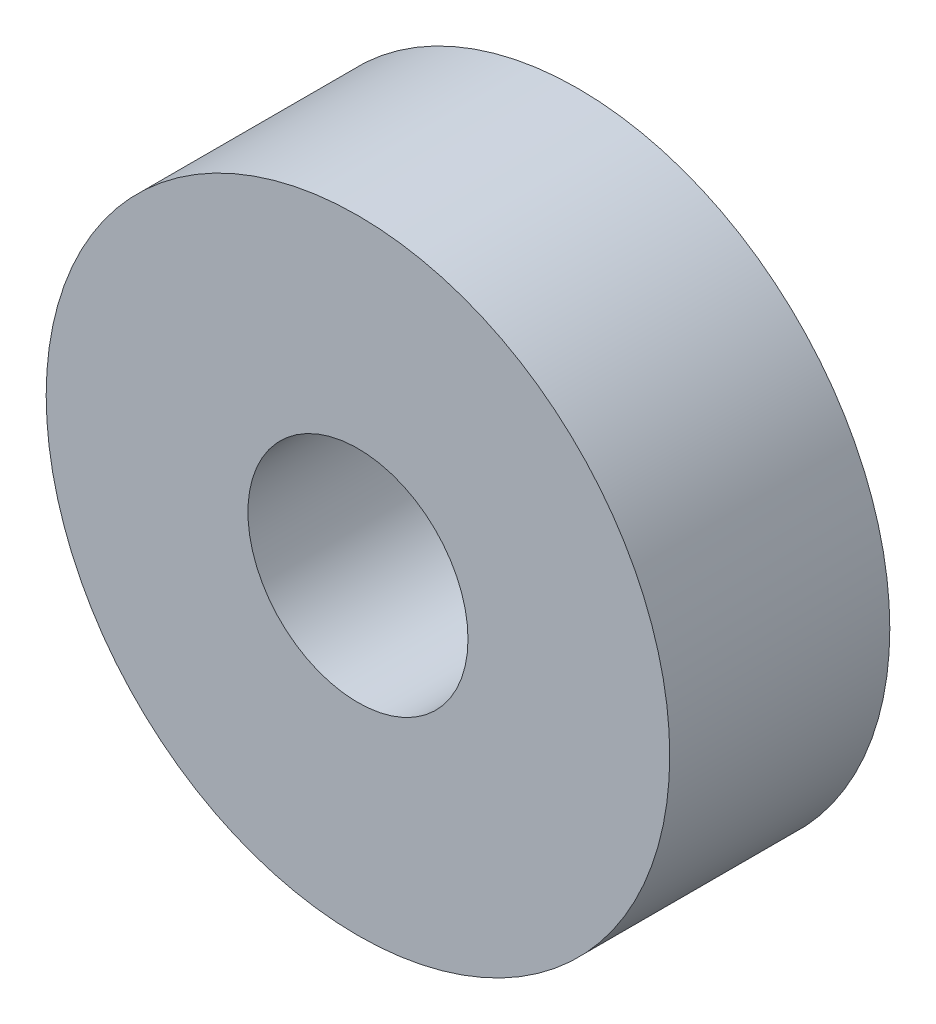
ISO-10303-21;
HEADER;
FILE_DESCRIPTION(('STEP AP214'),'2;1');
FILE_NAME('part.step','',(''),(''),'','','');
FILE_SCHEMA(('AUTOMOTIVE_DESIGN { 1 0 10303 214 1 1 1 1 }'));
ENDSEC;
DATA;
#1=APPLICATION_CONTEXT('core data for automotive mechanical design processes');
#2=APPLICATION_PROTOCOL_DEFINITION('international standard','automotive_design',2000,#1);
#3=PRODUCT_CONTEXT('',#1,'mechanical');
#4=PRODUCT('Part','Part','',(#3));
#5=PRODUCT_RELATED_PRODUCT_CATEGORY('part','',(#4));
#6=PRODUCT_DEFINITION_FORMATION('','',#4);
#7=PRODUCT_DEFINITION_CONTEXT('part definition',#1,'design');
#8=PRODUCT_DEFINITION('design','',#6,#7);
#9=PRODUCT_DEFINITION_SHAPE('','',#8);
#10=(LENGTH_UNIT() NAMED_UNIT(*) SI_UNIT(.MILLI.,.METRE.));
#11=(NAMED_UNIT(*) PLANE_ANGLE_UNIT() SI_UNIT($,.RADIAN.));
#12=(NAMED_UNIT(*) SI_UNIT($,.STERADIAN.) SOLID_ANGLE_UNIT());
#13=UNCERTAINTY_MEASURE_WITH_UNIT(LENGTH_MEASURE(1.E-05),#10,'distance_accuracy_value','');
#14=(GEOMETRIC_REPRESENTATION_CONTEXT(3) GLOBAL_UNCERTAINTY_ASSIGNED_CONTEXT((#13)) GLOBAL_UNIT_ASSIGNED_CONTEXT((#10,
#11,#12)) REPRESENTATION_CONTEXT('',''));
#15=CARTESIAN_POINT('',(0.,0.,0.));
#16=DIRECTION('',(0.,0.,1.));
#17=DIRECTION('',(1.,0.,0.));
#18=AXIS2_PLACEMENT_3D('',#15,#16,#17);
#19=CARTESIAN_POINT('',(0.,0.,3.));
#20=DIRECTION('',(0.,0.,1.));
#21=DIRECTION('',(1.,0.,0.));
#22=AXIS2_PLACEMENT_3D('',#19,#20,#21);
#23=PLANE('',#22);
#24=CARTESIAN_POINT('',(0.,0.,3.));
#25=DIRECTION('',(0.,0.,1.));
#26=DIRECTION('',(1.,0.,0.));
#27=AXIS2_PLACEMENT_3D('',#24,#25,#26);
#28=CIRCLE('',#27,8.5);
#29=CARTESIAN_POINT('',(8.5,0.,3.));
#30=VERTEX_POINT('',#29);
#31=EDGE_CURVE('E10',#30,#30,#28,.T.);
#32=ORIENTED_EDGE('',*,*,#31,.T.);
#33=EDGE_LOOP('',(#32));
#34=FACE_BOUND('',#33,.T.);
#35=CARTESIAN_POINT('',(0.,0.,3.));
#36=DIRECTION('',(0.,0.,1.));
#37=DIRECTION('',(1.,0.,0.));
#38=AXIS2_PLACEMENT_3D('',#35,#36,#37);
#39=CIRCLE('',#38,3.);
#40=CARTESIAN_POINT('',(3.,0.,3.));
#41=VERTEX_POINT('',#40);
#42=EDGE_CURVE('E44',#41,#41,#39,.T.);
#43=ORIENTED_EDGE('',*,*,#42,.F.);
#44=EDGE_LOOP('',(#43));
#45=FACE_BOUND('',#44,.T.);
#46=ADVANCED_FACE('F33',(#34,#45),#23,.T.);
#47=CARTESIAN_POINT('',(0.,0.,-3.));
#48=DIRECTION('',(0.,0.,1.));
#49=DIRECTION('',(1.,0.,0.));
#50=AXIS2_PLACEMENT_3D('',#47,#48,#49);
#51=PLANE('',#50);
#52=CARTESIAN_POINT('',(0.,0.,-3.));
#53=DIRECTION('',(0.,0.,1.));
#54=DIRECTION('',(1.,0.,0.));
#55=AXIS2_PLACEMENT_3D('',#52,#53,#54);
#56=CIRCLE('',#55,8.5);
#57=CARTESIAN_POINT('',(8.5,0.,-3.));
#58=VERTEX_POINT('',#57);
#59=EDGE_CURVE('E37',#58,#58,#56,.T.);
#60=ORIENTED_EDGE('',*,*,#59,.F.);
#61=EDGE_LOOP('',(#60));
#62=FACE_BOUND('',#61,.T.);
#63=CARTESIAN_POINT('',(0.,0.,-3.));
#64=DIRECTION('',(0.,0.,1.));
#65=DIRECTION('',(1.,0.,0.));
#66=AXIS2_PLACEMENT_3D('',#63,#64,#65);
#67=CIRCLE('',#66,3.);
#68=CARTESIAN_POINT('',(3.,0.,-3.));
#69=VERTEX_POINT('',#68);
#70=EDGE_CURVE('E46',#69,#69,#67,.T.);
#71=ORIENTED_EDGE('',*,*,#70,.T.);
#72=EDGE_LOOP('',(#71));
#73=FACE_BOUND('',#72,.T.);
#74=ADVANCED_FACE('F56',(#62,#73),#51,.F.);
#75=CARTESIAN_POINT('',(0.,0.,3.));
#76=DIRECTION('',(0.,0.,-1.));
#77=DIRECTION('',(-1.,0.,0.));
#78=AXIS2_PLACEMENT_3D('',#75,#76,#77);
#79=CYLINDRICAL_SURFACE('',#78,8.5);
#80=ORIENTED_EDGE('',*,*,#31,.F.);
#81=EDGE_LOOP('',(#80));
#82=FACE_BOUND('',#81,.T.);
#83=ORIENTED_EDGE('',*,*,#59,.T.);
#84=EDGE_LOOP('',(#83));
#85=FACE_BOUND('',#84,.T.);
#86=ADVANCED_FACE('F35',(#82,#85),#79,.T.);
#87=CARTESIAN_POINT('',(0.,0.,3.));
#88=DIRECTION('',(0.,0.,-1.));
#89=DIRECTION('',(-1.,0.,0.));
#90=AXIS2_PLACEMENT_3D('',#87,#88,#89);
#91=CYLINDRICAL_SURFACE('',#90,3.);
#92=ORIENTED_EDGE('',*,*,#42,.T.);
#93=EDGE_LOOP('',(#92));
#94=FACE_BOUND('',#93,.T.);
#95=ORIENTED_EDGE('',*,*,#70,.F.);
#96=EDGE_LOOP('',(#95));
#97=FACE_BOUND('',#96,.T.);
#98=ADVANCED_FACE('F52',(#94,#97),#91,.F.);
#99=CLOSED_SHELL('',(#46,#74,#86,#98));
#100=MANIFOLD_SOLID_BREP('B2',#99);
#101=ADVANCED_BREP_SHAPE_REPRESENTATION('',(#18,#100),#14);
#102=SHAPE_DEFINITION_REPRESENTATION(#9,#101);
ENDSEC;
END-ISO-10303-21;
